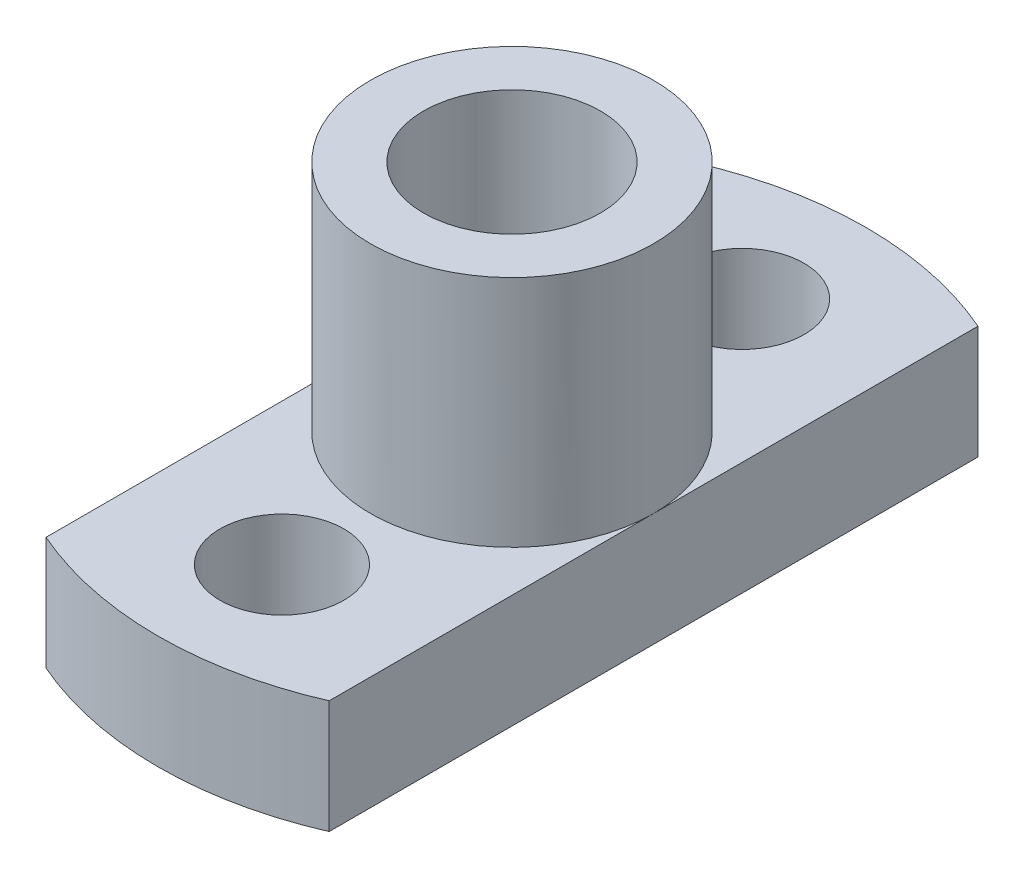
ISO-10303-21;
HEADER;
FILE_DESCRIPTION(('STEP AP214'),'2;1');
FILE_NAME('part.step','',(''),(''),'','','');
FILE_SCHEMA(('AUTOMOTIVE_DESIGN { 1 0 10303 214 1 1 1 1 }'));
ENDSEC;
DATA;
#1=APPLICATION_CONTEXT('core data for automotive mechanical design processes');
#2=APPLICATION_PROTOCOL_DEFINITION('international standard','automotive_design',2000,#1);
#3=PRODUCT_CONTEXT('',#1,'mechanical');
#4=PRODUCT('Part','Part','',(#3));
#5=PRODUCT_RELATED_PRODUCT_CATEGORY('part','',(#4));
#6=PRODUCT_DEFINITION_FORMATION('','',#4);
#7=PRODUCT_DEFINITION_CONTEXT('part definition',#1,'design');
#8=PRODUCT_DEFINITION('design','',#6,#7);
#9=PRODUCT_DEFINITION_SHAPE('','',#8);
#10=(LENGTH_UNIT() NAMED_UNIT(*) SI_UNIT(.MILLI.,.METRE.));
#11=(NAMED_UNIT(*) PLANE_ANGLE_UNIT() SI_UNIT($,.RADIAN.));
#12=(NAMED_UNIT(*) SI_UNIT($,.STERADIAN.) SOLID_ANGLE_UNIT());
#13=UNCERTAINTY_MEASURE_WITH_UNIT(LENGTH_MEASURE(1.E-05),#10,'distance_accuracy_value','');
#14=(GEOMETRIC_REPRESENTATION_CONTEXT(3) GLOBAL_UNCERTAINTY_ASSIGNED_CONTEXT((#13)) GLOBAL_UNIT_ASSIGNED_CONTEXT((#10,
#11,#12)) REPRESENTATION_CONTEXT('',''));
#15=CARTESIAN_POINT('',(0.,0.,0.));
#16=DIRECTION('',(0.,0.,1.));
#17=DIRECTION('',(1.,0.,0.));
#18=AXIS2_PLACEMENT_3D('',#15,#16,#17);
#19=CARTESIAN_POINT('',(0.,3.2,0.));
#20=DIRECTION('',(0.,1.,0.));
#21=DIRECTION('',(0.,0.,1.));
#22=AXIS2_PLACEMENT_3D('',#19,#20,#21);
#23=PLANE('',#22);
#24=CARTESIAN_POINT('',(0.,3.2,0.));
#25=DIRECTION('',(0.,1.,0.));
#26=DIRECTION('',(0.,0.,1.));
#27=AXIS2_PLACEMENT_3D('',#24,#25,#26);
#28=CIRCLE('',#27,4.);
#29=CARTESIAN_POINT('',(4.,3.2,0.));
#30=VERTEX_POINT('',#29);
#31=CARTESIAN_POINT('',(-4.,3.2,0.));
#32=VERTEX_POINT('',#31);
#33=EDGE_CURVE('E48',#30,#32,#28,.T.);
#34=ORIENTED_EDGE('',*,*,#33,.F.);
#35=DIRECTION('',(0.,0.,-1.));
#36=VECTOR('',#35,1.);
#37=CARTESIAN_POINT('',(4.,3.2,-9.16515138991168));
#38=LINE('',#37,#36);
#39=CARTESIAN_POINT('',(4.,3.2,-9.16515138991168));
#40=VERTEX_POINT('',#39);
#41=EDGE_CURVE('E62',#30,#40,#38,.T.);
#42=ORIENTED_EDGE('',*,*,#41,.T.);
#43=CARTESIAN_POINT('',(0.,3.2,0.));
#44=DIRECTION('',(0.,1.,0.));
#45=DIRECTION('',(0.,0.,1.));
#46=AXIS2_PLACEMENT_3D('',#43,#44,#45);
#47=CIRCLE('',#46,10.);
#48=CARTESIAN_POINT('',(-4.,3.2,-9.16515138991168));
#49=VERTEX_POINT('',#48);
#50=EDGE_CURVE('E163',#40,#49,#47,.T.);
#51=ORIENTED_EDGE('',*,*,#50,.T.);
#52=DIRECTION('',(0.,0.,1.));
#53=VECTOR('',#52,1.);
#54=CARTESIAN_POINT('',(-4.,3.2,-9.16515138991168));
#55=LINE('',#54,#53);
#56=EDGE_CURVE('E91',#49,#32,#55,.T.);
#57=ORIENTED_EDGE('',*,*,#56,.T.);
#58=EDGE_LOOP('',(#34,#42,#51,#57));
#59=FACE_BOUND('',#58,.T.);
#60=CARTESIAN_POINT('',(0.,3.2,-6.5));
#61=DIRECTION('',(0.,1.,0.));
#62=DIRECTION('',(0.,0.,1.));
#63=AXIS2_PLACEMENT_3D('',#60,#61,#62);
#64=CIRCLE('',#63,1.75);
#65=CARTESIAN_POINT('',(0.,3.2,-4.75));
#66=VERTEX_POINT('',#65);
#67=EDGE_CURVE('E168',#66,#66,#64,.T.);
#68=ORIENTED_EDGE('',*,*,#67,.F.);
#69=EDGE_LOOP('',(#68));
#70=FACE_BOUND('',#69,.T.);
#71=ADVANCED_FACE('F38',(#59,#70),#23,.T.);
#72=EDGE_CURVE('E11',#32,#30,#28,.T.);
#73=ORIENTED_EDGE('',*,*,#72,.F.);
#74=CARTESIAN_POINT('',(-4.,3.2,9.16515138991168));
#75=VERTEX_POINT('',#74);
#76=EDGE_CURVE('E175',#32,#75,#55,.T.);
#77=ORIENTED_EDGE('',*,*,#76,.T.);
#78=CARTESIAN_POINT('',(0.,3.2,0.));
#79=DIRECTION('',(0.,1.,0.));
#80=DIRECTION('',(0.,0.,1.));
#81=AXIS2_PLACEMENT_3D('',#78,#79,#80);
#82=CIRCLE('',#81,10.);
#83=CARTESIAN_POINT('',(4.,3.2,9.16515138991168));
#84=VERTEX_POINT('',#83);
#85=EDGE_CURVE('E98',#75,#84,#82,.T.);
#86=ORIENTED_EDGE('',*,*,#85,.T.);
#87=EDGE_CURVE('E94',#84,#30,#38,.T.);
#88=ORIENTED_EDGE('',*,*,#87,.T.);
#89=EDGE_LOOP('',(#73,#77,#86,#88));
#90=FACE_BOUND('',#89,.T.);
#91=CARTESIAN_POINT('',(0.,3.2,6.5));
#92=DIRECTION('',(0.,1.,0.));
#93=DIRECTION('',(0.,0.,-1.));
#94=AXIS2_PLACEMENT_3D('',#91,#92,#93);
#95=CIRCLE('',#94,1.75);
#96=CARTESIAN_POINT('',(0.,3.2,4.75));
#97=VERTEX_POINT('',#96);
#98=EDGE_CURVE('E178',#97,#97,#95,.T.);
#99=ORIENTED_EDGE('',*,*,#98,.F.);
#100=EDGE_LOOP('',(#99));
#101=FACE_BOUND('',#100,.T.);
#102=ADVANCED_FACE('F95',(#90,#101),#23,.T.);
#103=CARTESIAN_POINT('',(0.,0.,0.));
#104=DIRECTION('',(0.,1.,0.));
#105=DIRECTION('',(0.,0.,1.));
#106=AXIS2_PLACEMENT_3D('',#103,#104,#105);
#107=PLANE('',#106);
#108=CARTESIAN_POINT('',(0.,0.,0.));
#109=DIRECTION('',(0.,1.,0.));
#110=DIRECTION('',(0.,0.,1.));
#111=AXIS2_PLACEMENT_3D('',#108,#109,#110);
#112=CIRCLE('',#111,2.5);
#113=CARTESIAN_POINT('',(0.,0.,2.5));
#114=VERTEX_POINT('',#113);
#115=EDGE_CURVE('E108',#114,#114,#112,.T.);
#116=ORIENTED_EDGE('',*,*,#115,.T.);
#117=EDGE_LOOP('',(#116));
#118=FACE_BOUND('',#117,.T.);
#119=CARTESIAN_POINT('',(0.,0.,0.));
#120=DIRECTION('',(0.,1.,0.));
#121=DIRECTION('',(0.,0.,1.));
#122=AXIS2_PLACEMENT_3D('',#119,#120,#121);
#123=CIRCLE('',#122,10.);
#124=CARTESIAN_POINT('',(4.,0.,-9.16515138991168));
#125=VERTEX_POINT('',#124);
#126=CARTESIAN_POINT('',(-4.,0.,-9.16515138991168));
#127=VERTEX_POINT('',#126);
#128=EDGE_CURVE('E158',#125,#127,#123,.T.);
#129=ORIENTED_EDGE('',*,*,#128,.F.);
#130=DIRECTION('',(0.,0.,-1.));
#131=VECTOR('',#130,1.);
#132=CARTESIAN_POINT('',(4.,0.,-9.16515138991168));
#133=LINE('',#132,#131);
#134=CARTESIAN_POINT('',(4.,0.,9.16515138991168));
#135=VERTEX_POINT('',#134);
#136=EDGE_CURVE('E84',#135,#125,#133,.T.);
#137=ORIENTED_EDGE('',*,*,#136,.F.);
#138=CARTESIAN_POINT('',(0.,0.,0.));
#139=DIRECTION('',(0.,1.,0.));
#140=DIRECTION('',(0.,0.,1.));
#141=AXIS2_PLACEMENT_3D('',#138,#139,#140);
#142=CIRCLE('',#141,10.);
#143=CARTESIAN_POINT('',(-4.,0.,9.16515138991168));
#144=VERTEX_POINT('',#143);
#145=EDGE_CURVE('E157',#144,#135,#142,.T.);
#146=ORIENTED_EDGE('',*,*,#145,.F.);
#147=DIRECTION('',(0.,0.,1.));
#148=VECTOR('',#147,1.);
#149=CARTESIAN_POINT('',(-4.,0.,-9.16515138991168));
#150=LINE('',#149,#148);
#151=EDGE_CURVE('E149',#127,#144,#150,.T.);
#152=ORIENTED_EDGE('',*,*,#151,.F.);
#153=EDGE_LOOP('',(#129,#137,#146,#152));
#154=FACE_BOUND('',#153,.T.);
#155=CARTESIAN_POINT('',(0.,0.,-6.5));
#156=DIRECTION('',(0.,1.,0.));
#157=DIRECTION('',(0.,0.,1.));
#158=AXIS2_PLACEMENT_3D('',#155,#156,#157);
#159=CIRCLE('',#158,1.75);
#160=CARTESIAN_POINT('',(0.,0.,-4.75));
#161=VERTEX_POINT('',#160);
#162=EDGE_CURVE('E170',#161,#161,#159,.T.);
#163=ORIENTED_EDGE('',*,*,#162,.T.);
#164=EDGE_LOOP('',(#163));
#165=FACE_BOUND('',#164,.T.);
#166=CARTESIAN_POINT('',(0.,0.,6.5));
#167=DIRECTION('',(0.,1.,0.));
#168=DIRECTION('',(0.,0.,-1.));
#169=AXIS2_PLACEMENT_3D('',#166,#167,#168);
#170=CIRCLE('',#169,1.75);
#171=CARTESIAN_POINT('',(0.,0.,4.75));
#172=VERTEX_POINT('',#171);
#173=EDGE_CURVE('E180',#172,#172,#170,.T.);
#174=ORIENTED_EDGE('',*,*,#173,.T.);
#175=EDGE_LOOP('',(#174));
#176=FACE_BOUND('',#175,.T.);
#177=ADVANCED_FACE('F131',(#118,#154,#165,#176),#107,.F.);
#178=CARTESIAN_POINT('',(0.,3.2,0.));
#179=DIRECTION('',(0.,-1.,0.));
#180=DIRECTION('',(0.,0.,-1.));
#181=AXIS2_PLACEMENT_3D('',#178,#179,#180);
#182=CYLINDRICAL_SURFACE('',#181,10.);
#183=ORIENTED_EDGE('',*,*,#128,.T.);
#184=DIRECTION('',(0.,-1.,0.));
#185=VECTOR('',#184,1.);
#186=CARTESIAN_POINT('',(-4.,3.2,-9.16515138991168));
#187=LINE('',#186,#185);
#188=EDGE_CURVE('E42',#49,#127,#187,.T.);
#189=ORIENTED_EDGE('',*,*,#188,.F.);
#190=ORIENTED_EDGE('',*,*,#50,.F.);
#191=DIRECTION('',(0.,-1.,0.));
#192=VECTOR('',#191,1.);
#193=CARTESIAN_POINT('',(4.,3.2,-9.16515138991168));
#194=LINE('',#193,#192);
#195=EDGE_CURVE('E100',#40,#125,#194,.T.);
#196=ORIENTED_EDGE('',*,*,#195,.T.);
#197=EDGE_LOOP('',(#183,#189,#190,#196));
#198=FACE_BOUND('',#197,.T.);
#199=ADVANCED_FACE('F40',(#198),#182,.T.);
#200=CARTESIAN_POINT('',(-4.,3.2,-9.16515138991168));
#201=DIRECTION('',(1.,0.,0.));
#202=DIRECTION('',(0.,0.,-1.));
#203=AXIS2_PLACEMENT_3D('',#200,#201,#202);
#204=PLANE('',#203);
#205=ORIENTED_EDGE('',*,*,#151,.T.);
#206=DIRECTION('',(0.,-1.,0.));
#207=VECTOR('',#206,1.);
#208=CARTESIAN_POINT('',(-4.,3.2,9.16515138991168));
#209=LINE('',#208,#207);
#210=EDGE_CURVE('E151',#75,#144,#209,.T.);
#211=ORIENTED_EDGE('',*,*,#210,.F.);
#212=ORIENTED_EDGE('',*,*,#76,.F.);
#213=ORIENTED_EDGE('',*,*,#56,.F.);
#214=ORIENTED_EDGE('',*,*,#188,.T.);
#215=EDGE_LOOP('',(#205,#211,#212,#213,#214));
#216=FACE_BOUND('',#215,.T.);
#217=ADVANCED_FACE('F141',(#216),#204,.F.);
#218=CARTESIAN_POINT('',(0.,3.2,0.));
#219=DIRECTION('',(0.,-1.,0.));
#220=DIRECTION('',(0.,0.,-1.));
#221=AXIS2_PLACEMENT_3D('',#218,#219,#220);
#222=CYLINDRICAL_SURFACE('',#221,10.);
#223=ORIENTED_EDGE('',*,*,#145,.T.);
#224=DIRECTION('',(0.,-1.,0.));
#225=VECTOR('',#224,1.);
#226=CARTESIAN_POINT('',(4.,3.2,9.16515138991168));
#227=LINE('',#226,#225);
#228=EDGE_CURVE('E160',#84,#135,#227,.T.);
#229=ORIENTED_EDGE('',*,*,#228,.F.);
#230=ORIENTED_EDGE('',*,*,#85,.F.);
#231=ORIENTED_EDGE('',*,*,#210,.T.);
#232=EDGE_LOOP('',(#223,#229,#230,#231));
#233=FACE_BOUND('',#232,.T.);
#234=ADVANCED_FACE('F139',(#233),#222,.T.);
#235=CARTESIAN_POINT('',(4.,3.2,-9.16515138991168));
#236=DIRECTION('',(-1.,0.,0.));
#237=DIRECTION('',(0.,0.,1.));
#238=AXIS2_PLACEMENT_3D('',#235,#236,#237);
#239=PLANE('',#238);
#240=ORIENTED_EDGE('',*,*,#136,.T.);
#241=ORIENTED_EDGE('',*,*,#195,.F.);
#242=ORIENTED_EDGE('',*,*,#41,.F.);
#243=ORIENTED_EDGE('',*,*,#87,.F.);
#244=ORIENTED_EDGE('',*,*,#228,.T.);
#245=EDGE_LOOP('',(#240,#241,#242,#243,#244));
#246=FACE_BOUND('',#245,.T.);
#247=ADVANCED_FACE('F102',(#246),#239,.F.);
#248=CARTESIAN_POINT('',(0.,3.2,-6.5));
#249=DIRECTION('',(0.,-1.,0.));
#250=DIRECTION('',(0.,0.,-1.));
#251=AXIS2_PLACEMENT_3D('',#248,#249,#250);
#252=CYLINDRICAL_SURFACE('',#251,1.75);
#253=ORIENTED_EDGE('',*,*,#67,.T.);
#254=EDGE_LOOP('',(#253));
#255=FACE_BOUND('',#254,.T.);
#256=ORIENTED_EDGE('',*,*,#162,.F.);
#257=EDGE_LOOP('',(#256));
#258=FACE_BOUND('',#257,.T.);
#259=ADVANCED_FACE('F122',(#255,#258),#252,.F.);
#260=CARTESIAN_POINT('',(0.,3.2,6.5));
#261=DIRECTION('',(0.,-1.,0.));
#262=DIRECTION('',(0.,0.,-1.));
#263=AXIS2_PLACEMENT_3D('',#260,#261,#262);
#264=CYLINDRICAL_SURFACE('',#263,1.75);
#265=ORIENTED_EDGE('',*,*,#98,.T.);
#266=EDGE_LOOP('',(#265));
#267=FACE_BOUND('',#266,.T.);
#268=ORIENTED_EDGE('',*,*,#173,.F.);
#269=EDGE_LOOP('',(#268));
#270=FACE_BOUND('',#269,.T.);
#271=ADVANCED_FACE('F112',(#267,#270),#264,.F.);
#272=CARTESIAN_POINT('',(0.,9.8,0.));
#273=DIRECTION('',(0.,-1.,0.));
#274=DIRECTION('',(0.,0.,-1.));
#275=AXIS2_PLACEMENT_3D('',#272,#273,#274);
#276=CYLINDRICAL_SURFACE('',#275,4.);
#277=CARTESIAN_POINT('',(0.,9.8,0.));
#278=DIRECTION('',(0.,1.,0.));
#279=DIRECTION('',(0.,0.,1.));
#280=AXIS2_PLACEMENT_3D('',#277,#278,#279);
#281=CIRCLE('',#280,4.);
#282=CARTESIAN_POINT('',(0.,9.8,4.));
#283=VERTEX_POINT('',#282);
#284=EDGE_CURVE('E107',#283,#283,#281,.T.);
#285=ORIENTED_EDGE('',*,*,#284,.F.);
#286=EDGE_LOOP('',(#285));
#287=FACE_BOUND('',#286,.T.);
#288=ORIENTED_EDGE('',*,*,#33,.T.);
#289=ORIENTED_EDGE('',*,*,#72,.T.);
#290=EDGE_LOOP('',(#288,#289));
#291=FACE_BOUND('',#290,.T.);
#292=ADVANCED_FACE('F109',(#287,#291),#276,.T.);
#293=CARTESIAN_POINT('',(0.,9.8,0.));
#294=DIRECTION('',(0.,1.,0.));
#295=DIRECTION('',(0.,0.,1.));
#296=AXIS2_PLACEMENT_3D('',#293,#294,#295);
#297=PLANE('',#296);
#298=CARTESIAN_POINT('',(0.,9.8,0.));
#299=DIRECTION('',(0.,1.,0.));
#300=DIRECTION('',(0.,0.,1.));
#301=AXIS2_PLACEMENT_3D('',#298,#299,#300);
#302=CIRCLE('',#301,2.5);
#303=CARTESIAN_POINT('',(0.,9.8,2.5));
#304=VERTEX_POINT('',#303);
#305=EDGE_CURVE('E187',#304,#304,#302,.T.);
#306=ORIENTED_EDGE('',*,*,#305,.F.);
#307=EDGE_LOOP('',(#306));
#308=FACE_BOUND('',#307,.T.);
#309=ORIENTED_EDGE('',*,*,#284,.T.);
#310=EDGE_LOOP('',(#309));
#311=FACE_BOUND('',#310,.T.);
#312=ADVANCED_FACE('F111',(#308,#311),#297,.T.);
#313=CARTESIAN_POINT('',(0.,0.,0.));
#314=DIRECTION('',(0.,1.,0.));
#315=DIRECTION('',(0.,0.,1.));
#316=AXIS2_PLACEMENT_3D('',#313,#314,#315);
#317=CYLINDRICAL_SURFACE('',#316,2.5);
#318=ORIENTED_EDGE('',*,*,#115,.F.);
#319=EDGE_LOOP('',(#318));
#320=FACE_BOUND('',#319,.T.);
#321=ORIENTED_EDGE('',*,*,#305,.T.);
#322=EDGE_LOOP('',(#321));
#323=FACE_BOUND('',#322,.T.);
#324=ADVANCED_FACE('F119',(#320,#323),#317,.F.);
#325=CLOSED_SHELL('',(#71,#102,#177,#199,#217,#234,#247,#259,#271,#292,#312,#324));
#326=MANIFOLD_SOLID_BREP('B2',#325);
#327=ADVANCED_BREP_SHAPE_REPRESENTATION('',(#18,#326),#14);
#328=SHAPE_DEFINITION_REPRESENTATION(#9,#327);
ENDSEC;
END-ISO-10303-21;
